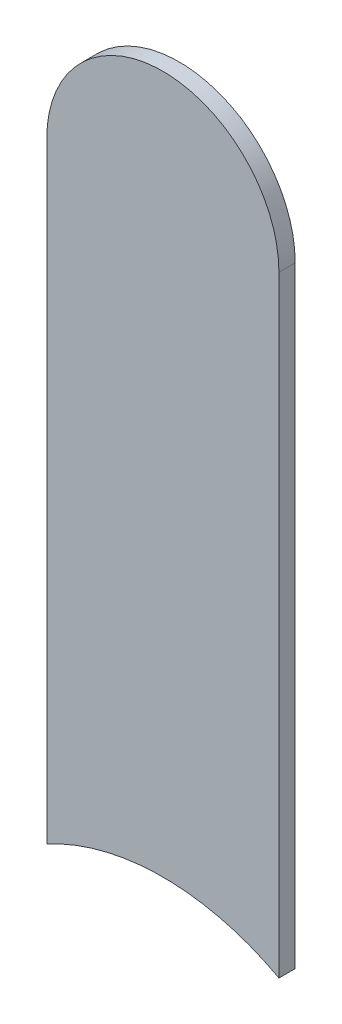
ISO-10303-21;
HEADER;
FILE_DESCRIPTION(('STEP AP214'),'2;1');
FILE_NAME('part.step','',(''),(''),'','','');
FILE_SCHEMA(('AUTOMOTIVE_DESIGN { 1 0 10303 214 1 1 1 1 }'));
ENDSEC;
DATA;
#1=APPLICATION_CONTEXT('core data for automotive mechanical design processes');
#2=APPLICATION_PROTOCOL_DEFINITION('international standard','automotive_design',2000,#1);
#3=PRODUCT_CONTEXT('',#1,'mechanical');
#4=PRODUCT('Part','Part','',(#3));
#5=PRODUCT_RELATED_PRODUCT_CATEGORY('part','',(#4));
#6=PRODUCT_DEFINITION_FORMATION('','',#4);
#7=PRODUCT_DEFINITION_CONTEXT('part definition',#1,'design');
#8=PRODUCT_DEFINITION('design','',#6,#7);
#9=PRODUCT_DEFINITION_SHAPE('','',#8);
#10=(LENGTH_UNIT() NAMED_UNIT(*) SI_UNIT(.MILLI.,.METRE.));
#11=(NAMED_UNIT(*) PLANE_ANGLE_UNIT() SI_UNIT($,.RADIAN.));
#12=(NAMED_UNIT(*) SI_UNIT($,.STERADIAN.) SOLID_ANGLE_UNIT());
#13=UNCERTAINTY_MEASURE_WITH_UNIT(LENGTH_MEASURE(1.E-05),#10,'distance_accuracy_value','');
#14=(GEOMETRIC_REPRESENTATION_CONTEXT(3) GLOBAL_UNCERTAINTY_ASSIGNED_CONTEXT((#13)) GLOBAL_UNIT_ASSIGNED_CONTEXT((#10,
#11,#12)) REPRESENTATION_CONTEXT('',''));
#15=CARTESIAN_POINT('',(0.,0.,0.));
#16=DIRECTION('',(0.,0.,1.));
#17=DIRECTION('',(1.,0.,0.));
#18=AXIS2_PLACEMENT_3D('',#15,#16,#17);
#19=CARTESIAN_POINT('',(131.602,-109.956,-0.035));
#20=DIRECTION('',(1.,0.,0.));
#21=DIRECTION('',(0.,1.,0.));
#22=AXIS2_PLACEMENT_3D('',#19,#20,#21);
#23=PLANE('',#22);
#24=DIRECTION('',(0.,0.,-1.));
#25=VECTOR('',#24,1.);
#26=CARTESIAN_POINT('',(131.602,-111.2723453671,-0.045));
#27=LINE('',#26,#25);
#28=CARTESIAN_POINT('',(131.602,-111.2723453671,0.));
#29=VERTEX_POINT('',#28);
#30=CARTESIAN_POINT('',(131.602,-111.2723453671,-0.035));
#31=VERTEX_POINT('',#30);
#32=EDGE_CURVE('E11',#29,#31,#27,.T.);
#33=ORIENTED_EDGE('',*,*,#32,.F.);
#34=DIRECTION('',(0.,-1.,0.));
#35=VECTOR('',#34,1.);
#36=CARTESIAN_POINT('',(131.602,-109.956,0.));
#37=LINE('',#36,#35);
#38=CARTESIAN_POINT('',(131.602,-109.956,0.));
#39=VERTEX_POINT('',#38);
#40=EDGE_CURVE('E20',#39,#29,#37,.T.);
#41=ORIENTED_EDGE('',*,*,#40,.F.);
#42=DIRECTION('',(0.,0.,1.));
#43=VECTOR('',#42,1.);
#44=CARTESIAN_POINT('',(131.602,-109.956,-0.035));
#45=LINE('',#44,#43);
#46=CARTESIAN_POINT('',(131.602,-109.956,-0.035));
#47=VERTEX_POINT('',#46);
#48=EDGE_CURVE('E104',#47,#39,#45,.T.);
#49=ORIENTED_EDGE('',*,*,#48,.F.);
#50=DIRECTION('',(0.,-1.,0.));
#51=VECTOR('',#50,1.);
#52=CARTESIAN_POINT('',(131.602,-109.956,-0.035));
#53=LINE('',#52,#51);
#54=EDGE_CURVE('E75',#47,#31,#53,.T.);
#55=ORIENTED_EDGE('',*,*,#54,.T.);
#56=EDGE_LOOP('',(#33,#41,#49,#55));
#57=FACE_BOUND('',#56,.T.);
#58=ADVANCED_FACE('F17',(#57),#23,.F.);
#59=CARTESIAN_POINT('',(131.852,-111.734,-0.045));
#60=DIRECTION('',(0.,0.,-1.));
#61=DIRECTION('',(0.,-1.,0.));
#62=AXIS2_PLACEMENT_3D('',#59,#60,#61);
#63=CYLINDRICAL_SURFACE('',#62,0.525);
#64=DIRECTION('',(0.,0.,-1.));
#65=VECTOR('',#64,1.);
#66=CARTESIAN_POINT('',(132.102,-111.2723453671,-0.045));
#67=LINE('',#66,#65);
#68=CARTESIAN_POINT('',(132.102,-111.2723453671,0.));
#69=VERTEX_POINT('',#68);
#70=CARTESIAN_POINT('',(132.102,-111.2723453671,-0.035));
#71=VERTEX_POINT('',#70);
#72=EDGE_CURVE('E88',#69,#71,#67,.T.);
#73=ORIENTED_EDGE('',*,*,#72,.F.);
#74=CARTESIAN_POINT('',(131.852,-111.734,0.));
#75=DIRECTION('',(0.,0.,-1.));
#76=DIRECTION('',(0.,-1.,0.));
#77=AXIS2_PLACEMENT_3D('',#74,#75,#76);
#78=CIRCLE('',#77,0.525);
#79=EDGE_CURVE('E108',#29,#69,#78,.T.);
#80=ORIENTED_EDGE('',*,*,#79,.F.);
#81=ORIENTED_EDGE('',*,*,#32,.T.);
#82=CARTESIAN_POINT('',(131.852,-111.734,-0.035));
#83=DIRECTION('',(0.,0.,-1.));
#84=DIRECTION('',(0.,-1.,0.));
#85=AXIS2_PLACEMENT_3D('',#82,#83,#84);
#86=CIRCLE('',#85,0.525);
#87=EDGE_CURVE('E80',#31,#71,#86,.T.);
#88=ORIENTED_EDGE('',*,*,#87,.T.);
#89=EDGE_LOOP('',(#73,#80,#81,#88));
#90=FACE_BOUND('',#89,.T.);
#91=ADVANCED_FACE('F121',(#90),#63,.F.);
#92=CARTESIAN_POINT('',(132.102,-111.734,0.));
#93=DIRECTION('',(0.,0.,1.));
#94=DIRECTION('',(1.,0.,0.));
#95=AXIS2_PLACEMENT_3D('',#92,#93,#94);
#96=PLANE('',#95);
#97=ORIENTED_EDGE('',*,*,#79,.T.);
#98=DIRECTION('',(0.,1.,0.));
#99=VECTOR('',#98,1.);
#100=CARTESIAN_POINT('',(132.102,-111.734,0.));
#101=LINE('',#100,#99);
#102=CARTESIAN_POINT('',(132.102,-109.956,0.));
#103=VERTEX_POINT('',#102);
#104=EDGE_CURVE('E95',#69,#103,#101,.T.);
#105=ORIENTED_EDGE('',*,*,#104,.T.);
#106=CARTESIAN_POINT('',(131.852,-109.956,0.));
#107=DIRECTION('',(0.,0.,1.));
#108=DIRECTION('',(1.,0.,0.));
#109=AXIS2_PLACEMENT_3D('',#106,#107,#108);
#110=CIRCLE('',#109,0.25);
#111=EDGE_CURVE('E92',#103,#39,#110,.T.);
#112=ORIENTED_EDGE('',*,*,#111,.T.);
#113=ORIENTED_EDGE('',*,*,#40,.T.);
#114=EDGE_LOOP('',(#97,#105,#112,#113));
#115=FACE_BOUND('',#114,.T.);
#116=ADVANCED_FACE('F118',(#115),#96,.T.);
#117=CARTESIAN_POINT('',(131.852,-109.956,-0.035));
#118=DIRECTION('',(0.,0.,-1.));
#119=DIRECTION('',(1.,0.,0.));
#120=AXIS2_PLACEMENT_3D('',#117,#118,#119);
#121=CYLINDRICAL_SURFACE('',#120,0.25);
#122=CARTESIAN_POINT('',(131.852,-109.956,-0.035));
#123=DIRECTION('',(0.,0.,1.));
#124=DIRECTION('',(1.,0.,0.));
#125=AXIS2_PLACEMENT_3D('',#122,#123,#124);
#126=CIRCLE('',#125,0.25);
#127=CARTESIAN_POINT('',(132.102,-109.956,-0.035));
#128=VERTEX_POINT('',#127);
#129=EDGE_CURVE('E69',#128,#47,#126,.T.);
#130=ORIENTED_EDGE('',*,*,#129,.T.);
#131=ORIENTED_EDGE('',*,*,#48,.T.);
#132=ORIENTED_EDGE('',*,*,#111,.F.);
#133=DIRECTION('',(0.,0.,1.));
#134=VECTOR('',#133,1.);
#135=CARTESIAN_POINT('',(132.102,-109.956,-0.035));
#136=LINE('',#135,#134);
#137=EDGE_CURVE('E86',#128,#103,#136,.T.);
#138=ORIENTED_EDGE('',*,*,#137,.F.);
#139=EDGE_LOOP('',(#130,#131,#132,#138));
#140=FACE_BOUND('',#139,.T.);
#141=ADVANCED_FACE('F91',(#140),#121,.T.);
#142=CARTESIAN_POINT('',(132.102,-111.734,-0.035));
#143=DIRECTION('',(0.,0.,1.));
#144=DIRECTION('',(1.,0.,0.));
#145=AXIS2_PLACEMENT_3D('',#142,#143,#144);
#146=PLANE('',#145);
#147=ORIENTED_EDGE('',*,*,#54,.F.);
#148=ORIENTED_EDGE('',*,*,#129,.F.);
#149=DIRECTION('',(0.,1.,0.));
#150=VECTOR('',#149,1.);
#151=CARTESIAN_POINT('',(132.102,-111.734,-0.035));
#152=LINE('',#151,#150);
#153=EDGE_CURVE('E73',#71,#128,#152,.T.);
#154=ORIENTED_EDGE('',*,*,#153,.F.);
#155=ORIENTED_EDGE('',*,*,#87,.F.);
#156=EDGE_LOOP('',(#147,#148,#154,#155));
#157=FACE_BOUND('',#156,.T.);
#158=ADVANCED_FACE('F71',(#157),#146,.F.);
#159=CARTESIAN_POINT('',(132.102,-111.734,-0.035));
#160=DIRECTION('',(-1.,0.,0.));
#161=DIRECTION('',(0.,0.,1.));
#162=AXIS2_PLACEMENT_3D('',#159,#160,#161);
#163=PLANE('',#162);
#164=ORIENTED_EDGE('',*,*,#137,.T.);
#165=ORIENTED_EDGE('',*,*,#104,.F.);
#166=ORIENTED_EDGE('',*,*,#72,.T.);
#167=ORIENTED_EDGE('',*,*,#153,.T.);
#168=EDGE_LOOP('',(#164,#165,#166,#167));
#169=FACE_BOUND('',#168,.T.);
#170=ADVANCED_FACE('F84',(#169),#163,.F.);
#171=CLOSED_SHELL('',(#58,#91,#116,#141,#158,#170));
#172=MANIFOLD_SOLID_BREP('B1',#171);
#173=ADVANCED_BREP_SHAPE_REPRESENTATION('',(#18,#172),#14);
#174=SHAPE_DEFINITION_REPRESENTATION(#9,#173);
ENDSEC;
END-ISO-10303-21;
